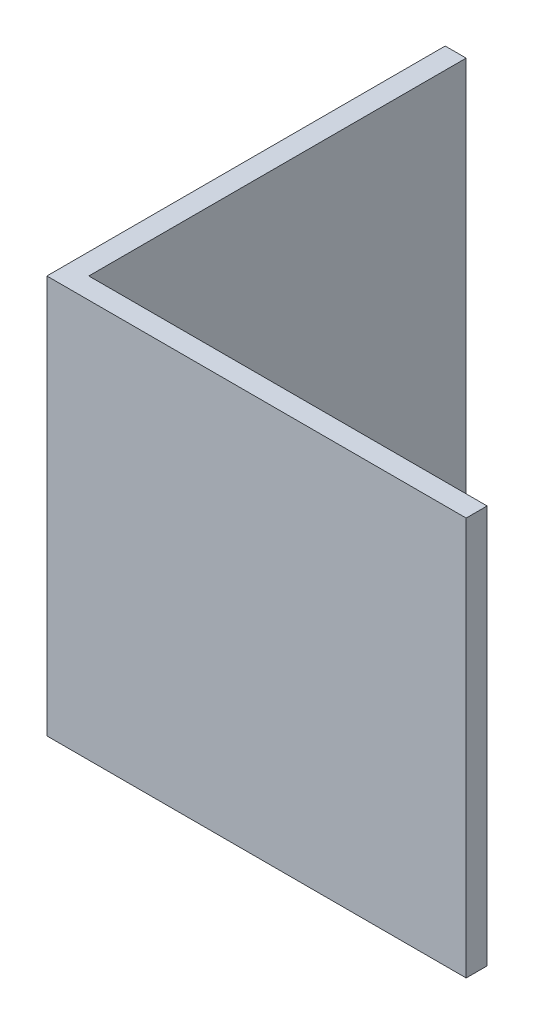
ISO-10303-21;
HEADER;
FILE_DESCRIPTION(('STEP AP214'),'2;1');
FILE_NAME('part.step','',(''),(''),'','','');
FILE_SCHEMA(('AUTOMOTIVE_DESIGN { 1 0 10303 214 1 1 1 1 }'));
ENDSEC;
DATA;
#1=APPLICATION_CONTEXT('core data for automotive mechanical design processes');
#2=APPLICATION_PROTOCOL_DEFINITION('international standard','automotive_design',2000,#1);
#3=PRODUCT_CONTEXT('',#1,'mechanical');
#4=PRODUCT('Part','Part','',(#3));
#5=PRODUCT_RELATED_PRODUCT_CATEGORY('part','',(#4));
#6=PRODUCT_DEFINITION_FORMATION('','',#4);
#7=PRODUCT_DEFINITION_CONTEXT('part definition',#1,'design');
#8=PRODUCT_DEFINITION('design','',#6,#7);
#9=PRODUCT_DEFINITION_SHAPE('','',#8);
#10=(LENGTH_UNIT() NAMED_UNIT(*) SI_UNIT(.MILLI.,.METRE.));
#11=(NAMED_UNIT(*) PLANE_ANGLE_UNIT() SI_UNIT($,.RADIAN.));
#12=(NAMED_UNIT(*) SI_UNIT($,.STERADIAN.) SOLID_ANGLE_UNIT());
#13=UNCERTAINTY_MEASURE_WITH_UNIT(LENGTH_MEASURE(1.E-05),#10,'distance_accuracy_value','');
#14=(GEOMETRIC_REPRESENTATION_CONTEXT(3) GLOBAL_UNCERTAINTY_ASSIGNED_CONTEXT((#13)) GLOBAL_UNIT_ASSIGNED_CONTEXT((#10,
#11,#12)) REPRESENTATION_CONTEXT('',''));
#15=CARTESIAN_POINT('',(0.,0.,0.));
#16=DIRECTION('',(0.,0.,1.));
#17=DIRECTION('',(1.,0.,0.));
#18=AXIS2_PLACEMENT_3D('',#15,#16,#17);
#19=CARTESIAN_POINT('',(0.999999999999998,19.,-20.));
#20=DIRECTION('',(-1.,0.,0.));
#21=DIRECTION('',(0.,0.,1.));
#22=AXIS2_PLACEMENT_3D('',#19,#20,#21);
#23=PLANE('',#22);
#24=DIRECTION('',(0.,-1.,0.));
#25=VECTOR('',#24,1.);
#26=CARTESIAN_POINT('',(0.999999999999998,19.,-19.));
#27=LINE('',#26,#25);
#28=CARTESIAN_POINT('',(0.999999999999998,19.,-19.));
#29=VERTEX_POINT('',#28);
#30=CARTESIAN_POINT('',(0.999999999999998,0.,-19.));
#31=VERTEX_POINT('',#30);
#32=EDGE_CURVE('E52',#29,#31,#27,.T.);
#33=ORIENTED_EDGE('',*,*,#32,.F.);
#34=DIRECTION('',(0.,0.,-1.));
#35=VECTOR('',#34,1.);
#36=CARTESIAN_POINT('',(0.999999999999998,19.,-20.));
#37=LINE('',#36,#35);
#38=CARTESIAN_POINT('',(1.,19.,-0.999999999999997));
#39=VERTEX_POINT('',#38);
#40=EDGE_CURVE('E135',#39,#29,#37,.T.);
#41=ORIENTED_EDGE('',*,*,#40,.F.);
#42=DIRECTION('',(0.,-1.,0.));
#43=VECTOR('',#42,1.);
#44=CARTESIAN_POINT('',(1.,19.,-0.999999999999997));
#45=LINE('',#44,#43);
#46=CARTESIAN_POINT('',(1.,0.,-0.999999999999997));
#47=VERTEX_POINT('',#46);
#48=EDGE_CURVE('E121',#39,#47,#45,.T.);
#49=ORIENTED_EDGE('',*,*,#48,.T.);
#50=DIRECTION('',(0.,0.,-1.));
#51=VECTOR('',#50,1.);
#52=CARTESIAN_POINT('',(0.999999999999998,0.,-20.));
#53=LINE('',#52,#51);
#54=EDGE_CURVE('E112',#47,#31,#53,.T.);
#55=ORIENTED_EDGE('',*,*,#54,.T.);
#56=EDGE_LOOP('',(#33,#41,#49,#55));
#57=FACE_BOUND('',#56,.T.);
#58=ADVANCED_FACE('F37',(#57),#23,.F.);
#59=CARTESIAN_POINT('',(0.,19.,0.));
#60=DIRECTION('',(1.,0.,0.));
#61=DIRECTION('',(0.,0.,-1.));
#62=AXIS2_PLACEMENT_3D('',#59,#60,#61);
#63=PLANE('',#62);
#64=DIRECTION('',(0.,1.,0.));
#65=VECTOR('',#64,1.);
#66=CARTESIAN_POINT('',(0.,0.,-19.));
#67=LINE('',#66,#65);
#68=CARTESIAN_POINT('',(0.,0.,-19.));
#69=VERTEX_POINT('',#68);
#70=CARTESIAN_POINT('',(0.,19.,-19.));
#71=VERTEX_POINT('',#70);
#72=EDGE_CURVE('E99',#69,#71,#67,.T.);
#73=ORIENTED_EDGE('',*,*,#72,.F.);
#74=DIRECTION('',(0.,0.,1.));
#75=VECTOR('',#74,1.);
#76=CARTESIAN_POINT('',(0.,0.,0.));
#77=LINE('',#76,#75);
#78=CARTESIAN_POINT('',(0.,0.,0.));
#79=VERTEX_POINT('',#78);
#80=EDGE_CURVE('E83',#69,#79,#77,.T.);
#81=ORIENTED_EDGE('',*,*,#80,.T.);
#82=DIRECTION('',(0.,-1.,0.));
#83=VECTOR('',#82,1.);
#84=CARTESIAN_POINT('',(0.,19.,0.));
#85=LINE('',#84,#83);
#86=CARTESIAN_POINT('',(0.,19.,0.));
#87=VERTEX_POINT('',#86);
#88=EDGE_CURVE('E119',#87,#79,#85,.T.);
#89=ORIENTED_EDGE('',*,*,#88,.F.);
#90=DIRECTION('',(0.,0.,1.));
#91=VECTOR('',#90,1.);
#92=CARTESIAN_POINT('',(0.,19.,0.));
#93=LINE('',#92,#91);
#94=EDGE_CURVE('E61',#71,#87,#93,.T.);
#95=ORIENTED_EDGE('',*,*,#94,.F.);
#96=EDGE_LOOP('',(#73,#81,#89,#95));
#97=FACE_BOUND('',#96,.T.);
#98=ADVANCED_FACE('F104',(#97),#63,.F.);
#99=CARTESIAN_POINT('',(0.,19.,0.));
#100=DIRECTION('',(0.,-1.,0.));
#101=DIRECTION('',(0.,0.,-1.));
#102=AXIS2_PLACEMENT_3D('',#99,#100,#101);
#103=PLANE('',#102);
#104=DIRECTION('',(1.,0.,0.));
#105=VECTOR('',#104,1.);
#106=CARTESIAN_POINT('',(0.,19.,-19.));
#107=LINE('',#106,#105);
#108=EDGE_CURVE('E105',#71,#29,#107,.T.);
#109=ORIENTED_EDGE('',*,*,#108,.F.);
#110=ORIENTED_EDGE('',*,*,#94,.T.);
#111=DIRECTION('',(1.,0.,0.));
#112=VECTOR('',#111,1.);
#113=CARTESIAN_POINT('',(20.,19.,0.));
#114=LINE('',#113,#112);
#115=CARTESIAN_POINT('',(20.,19.,0.));
#116=VERTEX_POINT('',#115);
#117=EDGE_CURVE('E111',#87,#116,#114,.T.);
#118=ORIENTED_EDGE('',*,*,#117,.T.);
#119=DIRECTION('',(0.,0.,-1.));
#120=VECTOR('',#119,1.);
#121=CARTESIAN_POINT('',(20.,19.,-0.999999999999998));
#122=LINE('',#121,#120);
#123=CARTESIAN_POINT('',(20.,19.,-0.999999999999998));
#124=VERTEX_POINT('',#123);
#125=EDGE_CURVE('E90',#116,#124,#122,.T.);
#126=ORIENTED_EDGE('',*,*,#125,.T.);
#127=DIRECTION('',(-1.,0.,0.));
#128=VECTOR('',#127,1.);
#129=CARTESIAN_POINT('',(1.,19.,-0.999999999999997));
#130=LINE('',#129,#128);
#131=EDGE_CURVE('E129',#124,#39,#130,.T.);
#132=ORIENTED_EDGE('',*,*,#131,.T.);
#133=ORIENTED_EDGE('',*,*,#40,.T.);
#134=EDGE_LOOP('',(#109,#110,#118,#126,#132,#133));
#135=FACE_BOUND('',#134,.T.);
#136=ADVANCED_FACE('F143',(#135),#103,.F.);
#137=CARTESIAN_POINT('',(0.,0.,0.));
#138=DIRECTION('',(0.,-1.,0.));
#139=DIRECTION('',(0.,0.,-1.));
#140=AXIS2_PLACEMENT_3D('',#137,#138,#139);
#141=PLANE('',#140);
#142=ORIENTED_EDGE('',*,*,#80,.F.);
#143=DIRECTION('',(-1.,0.,0.));
#144=VECTOR('',#143,1.);
#145=CARTESIAN_POINT('',(0.999999999999998,0.,-19.));
#146=LINE('',#145,#144);
#147=EDGE_CURVE('E97',#31,#69,#146,.T.);
#148=ORIENTED_EDGE('',*,*,#147,.F.);
#149=ORIENTED_EDGE('',*,*,#54,.F.);
#150=DIRECTION('',(-1.,0.,0.));
#151=VECTOR('',#150,1.);
#152=CARTESIAN_POINT('',(1.,0.,-0.999999999999997));
#153=LINE('',#152,#151);
#154=CARTESIAN_POINT('',(20.,0.,-0.999999999999998));
#155=VERTEX_POINT('',#154);
#156=EDGE_CURVE('E115',#155,#47,#153,.T.);
#157=ORIENTED_EDGE('',*,*,#156,.F.);
#158=DIRECTION('',(0.,0.,-1.));
#159=VECTOR('',#158,1.);
#160=CARTESIAN_POINT('',(20.,0.,-0.999999999999998));
#161=LINE('',#160,#159);
#162=CARTESIAN_POINT('',(20.,0.,0.));
#163=VERTEX_POINT('',#162);
#164=EDGE_CURVE('E130',#163,#155,#161,.T.);
#165=ORIENTED_EDGE('',*,*,#164,.F.);
#166=DIRECTION('',(1.,0.,0.));
#167=VECTOR('',#166,1.);
#168=CARTESIAN_POINT('',(20.,0.,0.));
#169=LINE('',#168,#167);
#170=EDGE_CURVE('E110',#79,#163,#169,.T.);
#171=ORIENTED_EDGE('',*,*,#170,.F.);
#172=EDGE_LOOP('',(#142,#148,#149,#157,#165,#171));
#173=FACE_BOUND('',#172,.T.);
#174=ADVANCED_FACE('F108',(#173),#141,.T.);
#175=CARTESIAN_POINT('',(20.,19.,0.));
#176=DIRECTION('',(0.,0.,-1.));
#177=DIRECTION('',(-1.,0.,0.));
#178=AXIS2_PLACEMENT_3D('',#175,#176,#177);
#179=PLANE('',#178);
#180=ORIENTED_EDGE('',*,*,#170,.T.);
#181=DIRECTION('',(0.,-1.,0.));
#182=VECTOR('',#181,1.);
#183=CARTESIAN_POINT('',(20.,19.,0.));
#184=LINE('',#183,#182);
#185=EDGE_CURVE('E11',#116,#163,#184,.T.);
#186=ORIENTED_EDGE('',*,*,#185,.F.);
#187=ORIENTED_EDGE('',*,*,#117,.F.);
#188=ORIENTED_EDGE('',*,*,#88,.T.);
#189=EDGE_LOOP('',(#180,#186,#187,#188));
#190=FACE_BOUND('',#189,.T.);
#191=ADVANCED_FACE('F39',(#190),#179,.F.);
#192=CARTESIAN_POINT('',(20.,19.,-0.999999999999998));
#193=DIRECTION('',(-1.,0.,0.));
#194=DIRECTION('',(0.,0.,1.));
#195=AXIS2_PLACEMENT_3D('',#192,#193,#194);
#196=PLANE('',#195);
#197=ORIENTED_EDGE('',*,*,#164,.T.);
#198=DIRECTION('',(0.,-1.,0.));
#199=VECTOR('',#198,1.);
#200=CARTESIAN_POINT('',(20.,19.,-0.999999999999998));
#201=LINE('',#200,#199);
#202=EDGE_CURVE('E45',#124,#155,#201,.T.);
#203=ORIENTED_EDGE('',*,*,#202,.F.);
#204=ORIENTED_EDGE('',*,*,#125,.F.);
#205=ORIENTED_EDGE('',*,*,#185,.T.);
#206=EDGE_LOOP('',(#197,#203,#204,#205));
#207=FACE_BOUND('',#206,.T.);
#208=ADVANCED_FACE('F147',(#207),#196,.F.);
#209=CARTESIAN_POINT('',(1.,19.,-0.999999999999997));
#210=DIRECTION('',(0.,0.,1.));
#211=DIRECTION('',(1.,0.,0.));
#212=AXIS2_PLACEMENT_3D('',#209,#210,#211);
#213=PLANE('',#212);
#214=ORIENTED_EDGE('',*,*,#156,.T.);
#215=ORIENTED_EDGE('',*,*,#48,.F.);
#216=ORIENTED_EDGE('',*,*,#131,.F.);
#217=ORIENTED_EDGE('',*,*,#202,.T.);
#218=EDGE_LOOP('',(#214,#215,#216,#217));
#219=FACE_BOUND('',#218,.T.);
#220=ADVANCED_FACE('F127',(#219),#213,.F.);
#221=CARTESIAN_POINT('',(0.,0.,-19.));
#222=DIRECTION('',(0.,0.,-1.));
#223=DIRECTION('',(-1.,0.,0.));
#224=AXIS2_PLACEMENT_3D('',#221,#222,#223);
#225=PLANE('',#224);
#226=ORIENTED_EDGE('',*,*,#32,.T.);
#227=ORIENTED_EDGE('',*,*,#147,.T.);
#228=ORIENTED_EDGE('',*,*,#72,.T.);
#229=ORIENTED_EDGE('',*,*,#108,.T.);
#230=EDGE_LOOP('',(#226,#227,#228,#229));
#231=FACE_BOUND('',#230,.T.);
#232=ADVANCED_FACE('F98',(#231),#225,.T.);
#233=CLOSED_SHELL('',(#58,#98,#136,#174,#191,#208,#220,#232));
#234=MANIFOLD_SOLID_BREP('B2',#233);
#235=ADVANCED_BREP_SHAPE_REPRESENTATION('',(#18,#234),#14);
#236=SHAPE_DEFINITION_REPRESENTATION(#9,#235);
ENDSEC;
END-ISO-10303-21;
